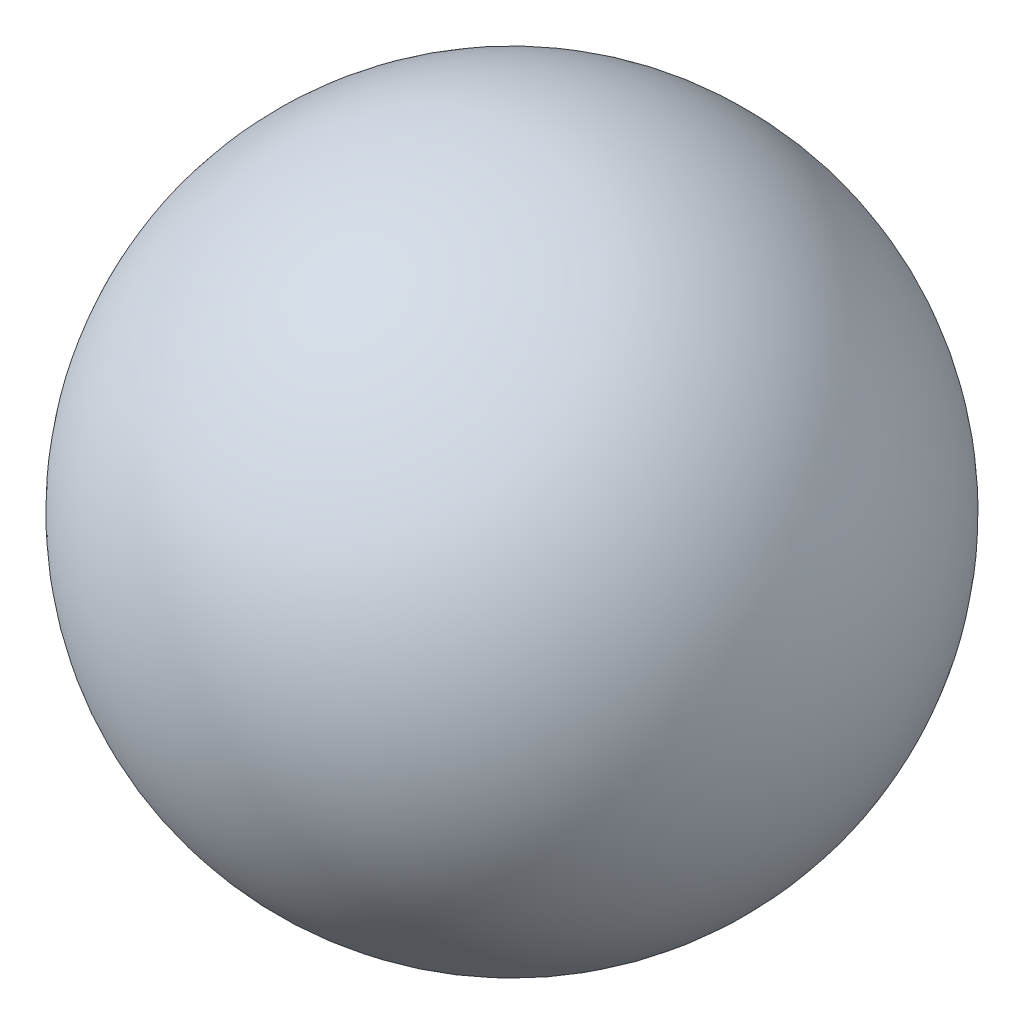
ISO-10303-21;
HEADER;
FILE_DESCRIPTION(('STEP AP214'),'2;1');
FILE_NAME('part.step','',(''),(''),'','','');
FILE_SCHEMA(('AUTOMOTIVE_DESIGN { 1 0 10303 214 1 1 1 1 }'));
ENDSEC;
DATA;
#1=APPLICATION_CONTEXT('core data for automotive mechanical design processes');
#2=APPLICATION_PROTOCOL_DEFINITION('international standard','automotive_design',2000,#1);
#3=PRODUCT_CONTEXT('',#1,'mechanical');
#4=PRODUCT('Part','Part','',(#3));
#5=PRODUCT_RELATED_PRODUCT_CATEGORY('part','',(#4));
#6=PRODUCT_DEFINITION_FORMATION('','',#4);
#7=PRODUCT_DEFINITION_CONTEXT('part definition',#1,'design');
#8=PRODUCT_DEFINITION('design','',#6,#7);
#9=PRODUCT_DEFINITION_SHAPE('','',#8);
#10=(LENGTH_UNIT() NAMED_UNIT(*) SI_UNIT(.MILLI.,.METRE.));
#11=(NAMED_UNIT(*) PLANE_ANGLE_UNIT() SI_UNIT($,.RADIAN.));
#12=(NAMED_UNIT(*) SI_UNIT($,.STERADIAN.) SOLID_ANGLE_UNIT());
#13=UNCERTAINTY_MEASURE_WITH_UNIT(LENGTH_MEASURE(1.E-05),#10,'distance_accuracy_value','');
#14=(GEOMETRIC_REPRESENTATION_CONTEXT(3) GLOBAL_UNCERTAINTY_ASSIGNED_CONTEXT((#13)) GLOBAL_UNIT_ASSIGNED_CONTEXT((#10,
#11,#12)) REPRESENTATION_CONTEXT('',''));
#15=CARTESIAN_POINT('',(0.,0.,0.));
#16=DIRECTION('',(0.,0.,1.));
#17=DIRECTION('',(1.,0.,0.));
#18=AXIS2_PLACEMENT_3D('',#15,#16,#17);
#19=CARTESIAN_POINT('',(0.,0.,0.));
#20=DIRECTION('',(-1.,0.,0.));
#21=DIRECTION('',(0.,1.,0.));
#22=AXIS2_PLACEMENT_3D('',#19,#20,#21);
#23=SPHERICAL_SURFACE('',#22,44.45);
#24=CARTESIAN_POINT('',(-44.45,0.,0.));
#25=VERTEX_POINT('',#24);
#26=VERTEX_LOOP('',#25);
#27=FACE_BOUND('',#26,.T.);
#28=ADVANCED_FACE('F34',(#27),#23,.T.);
#29=CLOSED_SHELL('',(#28));
#30=MANIFOLD_SOLID_BREP('B2',#29);
#31=ADVANCED_BREP_SHAPE_REPRESENTATION('',(#18,#30),#14);
#32=SHAPE_DEFINITION_REPRESENTATION(#9,#31);
ENDSEC;
END-ISO-10303-21;
